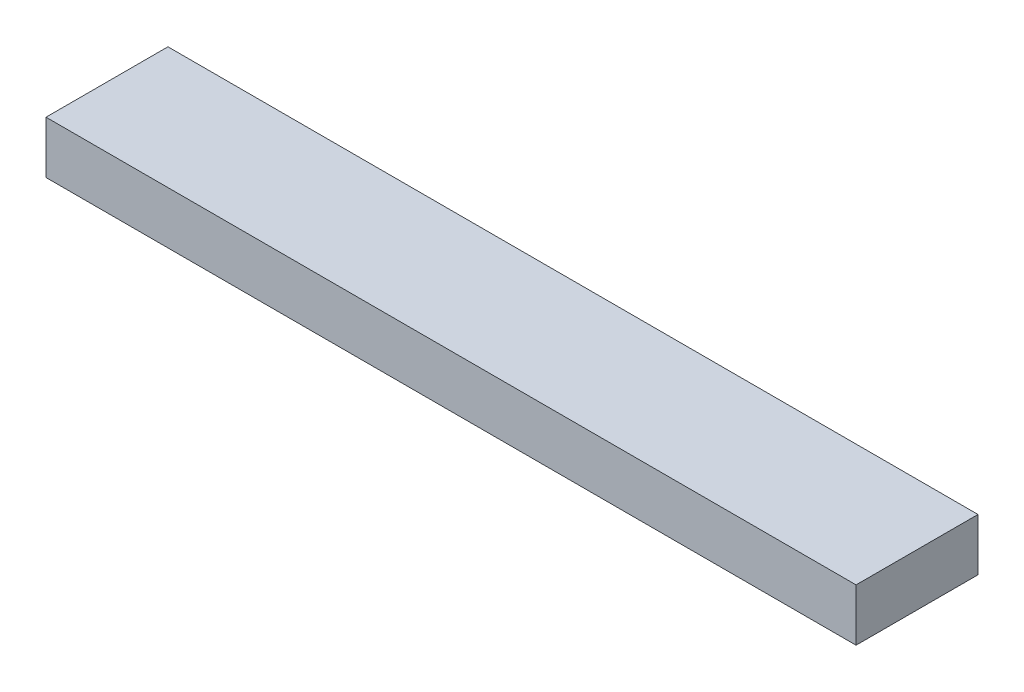
ISO-10303-21;
HEADER;
FILE_DESCRIPTION(('STEP AP214'),'2;1');
FILE_NAME('part.step','',(''),(''),'','','');
FILE_SCHEMA(('AUTOMOTIVE_DESIGN { 1 0 10303 214 1 1 1 1 }'));
ENDSEC;
DATA;
#1=APPLICATION_CONTEXT('core data for automotive mechanical design processes');
#2=APPLICATION_PROTOCOL_DEFINITION('international standard','automotive_design',2000,#1);
#3=PRODUCT_CONTEXT('',#1,'mechanical');
#4=PRODUCT('Part','Part','',(#3));
#5=PRODUCT_RELATED_PRODUCT_CATEGORY('part','',(#4));
#6=PRODUCT_DEFINITION_FORMATION('','',#4);
#7=PRODUCT_DEFINITION_CONTEXT('part definition',#1,'design');
#8=PRODUCT_DEFINITION('design','',#6,#7);
#9=PRODUCT_DEFINITION_SHAPE('','',#8);
#10=(LENGTH_UNIT() NAMED_UNIT(*) SI_UNIT(.MILLI.,.METRE.));
#11=(NAMED_UNIT(*) PLANE_ANGLE_UNIT() SI_UNIT($,.RADIAN.));
#12=(NAMED_UNIT(*) SI_UNIT($,.STERADIAN.) SOLID_ANGLE_UNIT());
#13=UNCERTAINTY_MEASURE_WITH_UNIT(LENGTH_MEASURE(1.E-05),#10,'distance_accuracy_value','');
#14=(GEOMETRIC_REPRESENTATION_CONTEXT(3) GLOBAL_UNCERTAINTY_ASSIGNED_CONTEXT((#13)) GLOBAL_UNIT_ASSIGNED_CONTEXT((#10,
#11,#12)) REPRESENTATION_CONTEXT('',''));
#15=CARTESIAN_POINT('',(0.,0.,0.));
#16=DIRECTION('',(0.,0.,1.));
#17=DIRECTION('',(1.,0.,0.));
#18=AXIS2_PLACEMENT_3D('',#15,#16,#17);
#19=CARTESIAN_POINT('',(0.,38.1,0.));
#20=DIRECTION('',(1.,0.,0.));
#21=DIRECTION('',(0.,0.,-1.));
#22=AXIS2_PLACEMENT_3D('',#19,#20,#21);
#23=PLANE('',#22);
#24=DIRECTION('',(0.,0.,1.));
#25=VECTOR('',#24,1.);
#26=CARTESIAN_POINT('',(0.,0.,0.));
#27=LINE('',#26,#25);
#28=CARTESIAN_POINT('',(0.,0.,-88.9));
#29=VERTEX_POINT('',#28);
#30=CARTESIAN_POINT('',(0.,0.,0.));
#31=VERTEX_POINT('',#30);
#32=EDGE_CURVE('E94',#29,#31,#27,.T.);
#33=ORIENTED_EDGE('',*,*,#32,.T.);
#34=DIRECTION('',(0.,-1.,0.));
#35=VECTOR('',#34,1.);
#36=CARTESIAN_POINT('',(0.,38.1,0.));
#37=LINE('',#36,#35);
#38=CARTESIAN_POINT('',(0.,38.1,0.));
#39=VERTEX_POINT('',#38);
#40=EDGE_CURVE('E11',#39,#31,#37,.T.);
#41=ORIENTED_EDGE('',*,*,#40,.F.);
#42=DIRECTION('',(0.,0.,1.));
#43=VECTOR('',#42,1.);
#44=CARTESIAN_POINT('',(0.,38.1,0.));
#45=LINE('',#44,#43);
#46=CARTESIAN_POINT('',(0.,38.1,-88.9));
#47=VERTEX_POINT('',#46);
#48=EDGE_CURVE('E82',#47,#39,#45,.T.);
#49=ORIENTED_EDGE('',*,*,#48,.F.);
#50=DIRECTION('',(0.,-1.,0.));
#51=VECTOR('',#50,1.);
#52=CARTESIAN_POINT('',(0.,38.1,-88.9));
#53=LINE('',#52,#51);
#54=EDGE_CURVE('E90',#47,#29,#53,.T.);
#55=ORIENTED_EDGE('',*,*,#54,.T.);
#56=EDGE_LOOP('',(#33,#41,#49,#55));
#57=FACE_BOUND('',#56,.T.);
#58=ADVANCED_FACE('F31',(#57),#23,.F.);
#59=CARTESIAN_POINT('',(0.,38.1,0.));
#60=DIRECTION('',(0.,0.,-1.));
#61=DIRECTION('',(-1.,0.,0.));
#62=AXIS2_PLACEMENT_3D('',#59,#60,#61);
#63=PLANE('',#62);
#64=DIRECTION('',(1.,0.,0.));
#65=VECTOR('',#64,1.);
#66=CARTESIAN_POINT('',(0.,0.,0.));
#67=LINE('',#66,#65);
#68=CARTESIAN_POINT('',(590.55,0.,0.));
#69=VERTEX_POINT('',#68);
#70=EDGE_CURVE('E86',#31,#69,#67,.T.);
#71=ORIENTED_EDGE('',*,*,#70,.T.);
#72=DIRECTION('',(0.,-1.,0.));
#73=VECTOR('',#72,1.);
#74=CARTESIAN_POINT('',(590.55,38.1,0.));
#75=LINE('',#74,#73);
#76=CARTESIAN_POINT('',(590.55,38.1,0.));
#77=VERTEX_POINT('',#76);
#78=EDGE_CURVE('E39',#77,#69,#75,.T.);
#79=ORIENTED_EDGE('',*,*,#78,.F.);
#80=DIRECTION('',(1.,0.,0.));
#81=VECTOR('',#80,1.);
#82=CARTESIAN_POINT('',(0.,38.1,0.));
#83=LINE('',#82,#81);
#84=EDGE_CURVE('E77',#39,#77,#83,.T.);
#85=ORIENTED_EDGE('',*,*,#84,.F.);
#86=ORIENTED_EDGE('',*,*,#40,.T.);
#87=EDGE_LOOP('',(#71,#79,#85,#86));
#88=FACE_BOUND('',#87,.T.);
#89=ADVANCED_FACE('F85',(#88),#63,.F.);
#90=CARTESIAN_POINT('',(590.55,38.1,0.));
#91=DIRECTION('',(-1.,0.,0.));
#92=DIRECTION('',(0.,0.,1.));
#93=AXIS2_PLACEMENT_3D('',#90,#91,#92);
#94=PLANE('',#93);
#95=DIRECTION('',(0.,0.,-1.));
#96=VECTOR('',#95,1.);
#97=CARTESIAN_POINT('',(590.55,0.,0.));
#98=LINE('',#97,#96);
#99=CARTESIAN_POINT('',(590.55,0.,-88.9));
#100=VERTEX_POINT('',#99);
#101=EDGE_CURVE('E64',#69,#100,#98,.T.);
#102=ORIENTED_EDGE('',*,*,#101,.T.);
#103=DIRECTION('',(0.,-1.,0.));
#104=VECTOR('',#103,1.);
#105=CARTESIAN_POINT('',(590.55,38.1,-88.9));
#106=LINE('',#105,#104);
#107=CARTESIAN_POINT('',(590.55,38.1,-88.9));
#108=VERTEX_POINT('',#107);
#109=EDGE_CURVE('E87',#108,#100,#106,.T.);
#110=ORIENTED_EDGE('',*,*,#109,.F.);
#111=DIRECTION('',(0.,0.,-1.));
#112=VECTOR('',#111,1.);
#113=CARTESIAN_POINT('',(590.55,38.1,0.));
#114=LINE('',#113,#112);
#115=EDGE_CURVE('E80',#77,#108,#114,.T.);
#116=ORIENTED_EDGE('',*,*,#115,.F.);
#117=ORIENTED_EDGE('',*,*,#78,.T.);
#118=EDGE_LOOP('',(#102,#110,#116,#117));
#119=FACE_BOUND('',#118,.T.);
#120=ADVANCED_FACE('F88',(#119),#94,.F.);
#121=CARTESIAN_POINT('',(0.,38.1,-88.9));
#122=DIRECTION('',(0.,0.,1.));
#123=DIRECTION('',(1.,0.,0.));
#124=AXIS2_PLACEMENT_3D('',#121,#122,#123);
#125=PLANE('',#124);
#126=DIRECTION('',(-1.,0.,0.));
#127=VECTOR('',#126,1.);
#128=CARTESIAN_POINT('',(0.,0.,-88.9));
#129=LINE('',#128,#127);
#130=EDGE_CURVE('E70',#100,#29,#129,.T.);
#131=ORIENTED_EDGE('',*,*,#130,.T.);
#132=ORIENTED_EDGE('',*,*,#54,.F.);
#133=DIRECTION('',(-1.,0.,0.));
#134=VECTOR('',#133,1.);
#135=CARTESIAN_POINT('',(0.,38.1,-88.9));
#136=LINE('',#135,#134);
#137=EDGE_CURVE('E47',#108,#47,#136,.T.);
#138=ORIENTED_EDGE('',*,*,#137,.F.);
#139=ORIENTED_EDGE('',*,*,#109,.T.);
#140=EDGE_LOOP('',(#131,#132,#138,#139));
#141=FACE_BOUND('',#140,.T.);
#142=ADVANCED_FACE('F101',(#141),#125,.F.);
#143=CARTESIAN_POINT('',(0.,38.1,-88.9));
#144=DIRECTION('',(0.,-1.,0.));
#145=DIRECTION('',(0.,0.,-1.));
#146=AXIS2_PLACEMENT_3D('',#143,#144,#145);
#147=PLANE('',#146);
#148=ORIENTED_EDGE('',*,*,#48,.T.);
#149=ORIENTED_EDGE('',*,*,#84,.T.);
#150=ORIENTED_EDGE('',*,*,#115,.T.);
#151=ORIENTED_EDGE('',*,*,#137,.T.);
#152=EDGE_LOOP('',(#148,#149,#150,#151));
#153=FACE_BOUND('',#152,.T.);
#154=ADVANCED_FACE('F78',(#153),#147,.F.);
#155=CARTESIAN_POINT('',(0.,0.,-88.9));
#156=DIRECTION('',(0.,-1.,0.));
#157=DIRECTION('',(0.,0.,-1.));
#158=AXIS2_PLACEMENT_3D('',#155,#156,#157);
#159=PLANE('',#158);
#160=ORIENTED_EDGE('',*,*,#32,.F.);
#161=ORIENTED_EDGE('',*,*,#130,.F.);
#162=ORIENTED_EDGE('',*,*,#101,.F.);
#163=ORIENTED_EDGE('',*,*,#70,.F.);
#164=EDGE_LOOP('',(#160,#161,#162,#163));
#165=FACE_BOUND('',#164,.T.);
#166=ADVANCED_FACE('F104',(#165),#159,.T.);
#167=CLOSED_SHELL('',(#58,#89,#120,#142,#154,#166));
#168=MANIFOLD_SOLID_BREP('B2',#167);
#169=ADVANCED_BREP_SHAPE_REPRESENTATION('',(#18,#168),#14);
#170=SHAPE_DEFINITION_REPRESENTATION(#9,#169);
ENDSEC;
END-ISO-10303-21;
